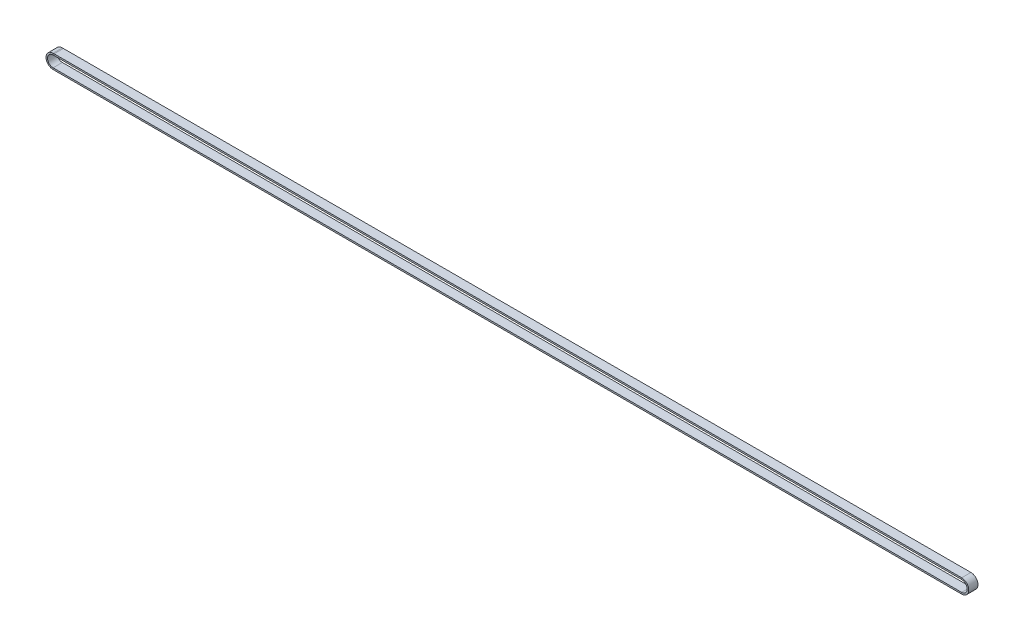
ISO-10303-21;
HEADER;
FILE_DESCRIPTION(('STEP AP214'),'2;1');
FILE_NAME('part.step','',(''),(''),'','','');
FILE_SCHEMA(('AUTOMOTIVE_DESIGN { 1 0 10303 214 1 1 1 1 }'));
ENDSEC;
DATA;
#1=APPLICATION_CONTEXT('core data for automotive mechanical design processes');
#2=APPLICATION_PROTOCOL_DEFINITION('international standard','automotive_design',2000,#1);
#3=PRODUCT_CONTEXT('',#1,'mechanical');
#4=PRODUCT('Part','Part','',(#3));
#5=PRODUCT_RELATED_PRODUCT_CATEGORY('part','',(#4));
#6=PRODUCT_DEFINITION_FORMATION('','',#4);
#7=PRODUCT_DEFINITION_CONTEXT('part definition',#1,'design');
#8=PRODUCT_DEFINITION('design','',#6,#7);
#9=PRODUCT_DEFINITION_SHAPE('','',#8);
#10=(LENGTH_UNIT() NAMED_UNIT(*) SI_UNIT(.MILLI.,.METRE.));
#11=(NAMED_UNIT(*) PLANE_ANGLE_UNIT() SI_UNIT($,.RADIAN.));
#12=(NAMED_UNIT(*) SI_UNIT($,.STERADIAN.) SOLID_ANGLE_UNIT());
#13=UNCERTAINTY_MEASURE_WITH_UNIT(LENGTH_MEASURE(1.E-05),#10,'distance_accuracy_value','');
#14=(GEOMETRIC_REPRESENTATION_CONTEXT(3) GLOBAL_UNCERTAINTY_ASSIGNED_CONTEXT((#13)) GLOBAL_UNIT_ASSIGNED_CONTEXT((#10,
#11,#12)) REPRESENTATION_CONTEXT('',''));
#15=CARTESIAN_POINT('',(0.,0.,0.));
#16=DIRECTION('',(0.,0.,1.));
#17=DIRECTION('',(1.,0.,0.));
#18=AXIS2_PLACEMENT_3D('',#15,#16,#17);
#19=CARTESIAN_POINT('',(883.5206378304,146.879342702496,-150.483366657725));
#20=DIRECTION('',(0.,0.,1.));
#21=DIRECTION('',(1.,0.,0.));
#22=AXIS2_PLACEMENT_3D('',#19,#20,#21);
#23=PLANE('',#22);
#24=DIRECTION('',(0.,1.,0.));
#25=VECTOR('',#24,1.);
#26=CARTESIAN_POINT('',(883.520637831255,146.879342702496,-150.483366657725));
#27=LINE('',#26,#25);
#28=CARTESIAN_POINT('',(883.520637831255,146.879342702496,-150.483366657725));
#29=VERTEX_POINT('',#28);
#30=CARTESIAN_POINT('',(883.520637831255,148.379342702496,-150.483366657725));
#31=VERTEX_POINT('',#30);
#32=EDGE_CURVE('E169',#29,#31,#27,.T.);
#33=ORIENTED_EDGE('',*,*,#32,.F.);
#34=DIRECTION('',(-1.,0.,0.));
#35=VECTOR('',#34,1.);
#36=CARTESIAN_POINT('',(883.5206378304,146.879342702496,-150.483366657725));
#37=LINE('',#36,#35);
#38=CARTESIAN_POINT('',(0.,146.879342702496,-150.483366657725));
#39=VERTEX_POINT('',#38);
#40=EDGE_CURVE('E168',#29,#39,#37,.T.);
#41=ORIENTED_EDGE('',*,*,#40,.T.);
#42=DIRECTION('',(0.,1.,0.));
#43=VECTOR('',#42,1.);
#44=CARTESIAN_POINT('',(0.,146.879342702496,-150.483366657725));
#45=LINE('',#44,#43);
#46=CARTESIAN_POINT('',(0.,148.379342702496,-150.483366657725));
#47=VERTEX_POINT('',#46);
#48=EDGE_CURVE('E143',#39,#47,#45,.T.);
#49=ORIENTED_EDGE('',*,*,#48,.T.);
#50=DIRECTION('',(-1.,0.,0.));
#51=VECTOR('',#50,1.);
#52=CARTESIAN_POINT('',(883.5206378304,148.379342702496,-150.483366657725));
#53=LINE('',#52,#51);
#54=EDGE_CURVE('E173',#31,#47,#53,.T.);
#55=ORIENTED_EDGE('',*,*,#54,.F.);
#56=EDGE_LOOP('',(#33,#41,#49,#55));
#57=FACE_BOUND('',#56,.T.);
#58=ADVANCED_FACE('F35',(#57),#23,.F.);
#59=CARTESIAN_POINT('',(0.,146.879342702496,-150.483366657725));
#60=DIRECTION('',(0.,0.,1.));
#61=DIRECTION('',(1.,0.,0.));
#62=AXIS2_PLACEMENT_3D('',#59,#60,#61);
#63=PLANE('',#62);
#64=DIRECTION('',(-1.,0.,0.));
#65=VECTOR('',#64,1.);
#66=CARTESIAN_POINT('',(0.,148.379342702496,-150.483366657725));
#67=LINE('',#66,#65);
#68=CARTESIAN_POINT('',(-1.00000000014302,148.379342702496,-150.483366657725));
#69=VERTEX_POINT('',#68);
#70=EDGE_CURVE('E149',#47,#69,#67,.T.);
#71=ORIENTED_EDGE('',*,*,#70,.F.);
#72=ORIENTED_EDGE('',*,*,#48,.F.);
#73=DIRECTION('',(-1.,0.,0.));
#74=VECTOR('',#73,1.);
#75=CARTESIAN_POINT('',(0.,146.879342702496,-150.483366657725));
#76=LINE('',#75,#74);
#77=CARTESIAN_POINT('',(-1.00000000014302,146.879342702496,-150.483366657725));
#78=VERTEX_POINT('',#77);
#79=EDGE_CURVE('E147',#39,#78,#76,.T.);
#80=ORIENTED_EDGE('',*,*,#79,.T.);
#81=DIRECTION('',(0.,1.,0.));
#82=VECTOR('',#81,1.);
#83=CARTESIAN_POINT('',(-1.00000000014302,146.879342702496,-150.483366657725));
#84=LINE('',#83,#82);
#85=EDGE_CURVE('E165',#78,#69,#84,.T.);
#86=ORIENTED_EDGE('',*,*,#85,.T.);
#87=EDGE_LOOP('',(#71,#72,#80,#86));
#88=FACE_BOUND('',#87,.T.);
#89=ADVANCED_FACE('F145',(#88),#63,.F.);
#90=CARTESIAN_POINT('',(0.,148.379342702496,-150.483366657725));
#91=DIRECTION('',(0.,-1.,0.));
#92=DIRECTION('',(0.,0.,-1.));
#93=AXIS2_PLACEMENT_3D('',#90,#91,#92);
#94=PLANE('',#93);
#95=DIRECTION('',(-1.,0.,0.));
#96=VECTOR('',#95,1.);
#97=CARTESIAN_POINT('',(0.,148.379342702496,-141.483366657725));
#98=LINE('',#97,#96);
#99=CARTESIAN_POINT('',(0.,148.379342702496,-141.483366657725));
#100=VERTEX_POINT('',#99);
#101=CARTESIAN_POINT('',(-1.00000000014302,148.379342702496,-141.483366657725));
#102=VERTEX_POINT('',#101);
#103=EDGE_CURVE('E214',#100,#102,#98,.T.);
#104=ORIENTED_EDGE('',*,*,#103,.F.);
#105=DIRECTION('',(0.,0.,1.));
#106=VECTOR('',#105,1.);
#107=CARTESIAN_POINT('',(0.,148.379342702496,-150.483366657725));
#108=LINE('',#107,#106);
#109=EDGE_CURVE('E154',#47,#100,#108,.T.);
#110=ORIENTED_EDGE('',*,*,#109,.F.);
#111=ORIENTED_EDGE('',*,*,#70,.T.);
#112=DIRECTION('',(0.,0.,1.));
#113=VECTOR('',#112,1.);
#114=CARTESIAN_POINT('',(-1.00000000014302,148.379342702496,-150.483366657725));
#115=LINE('',#114,#113);
#116=EDGE_CURVE('E239',#69,#102,#115,.T.);
#117=ORIENTED_EDGE('',*,*,#116,.T.);
#118=EDGE_LOOP('',(#104,#110,#111,#117));
#119=FACE_BOUND('',#118,.T.);
#120=ADVANCED_FACE('F259',(#119),#94,.F.);
#121=CARTESIAN_POINT('',(0.,146.879342702496,-141.483366657725));
#122=DIRECTION('',(0.,0.,-1.));
#123=DIRECTION('',(-1.,0.,0.));
#124=AXIS2_PLACEMENT_3D('',#121,#122,#123);
#125=PLANE('',#124);
#126=DIRECTION('',(-1.,0.,0.));
#127=VECTOR('',#126,1.);
#128=CARTESIAN_POINT('',(0.,146.879342702496,-141.483366657725));
#129=LINE('',#128,#127);
#130=CARTESIAN_POINT('',(0.,146.879342702496,-141.483366657725));
#131=VERTEX_POINT('',#130);
#132=CARTESIAN_POINT('',(-1.00000000014302,146.879342702496,-141.483366657725));
#133=VERTEX_POINT('',#132);
#134=EDGE_CURVE('E184',#131,#133,#129,.T.);
#135=ORIENTED_EDGE('',*,*,#134,.F.);
#136=DIRECTION('',(0.,-1.,0.));
#137=VECTOR('',#136,1.);
#138=CARTESIAN_POINT('',(0.,146.879342702496,-141.483366657725));
#139=LINE('',#138,#137);
#140=EDGE_CURVE('E176',#100,#131,#139,.T.);
#141=ORIENTED_EDGE('',*,*,#140,.F.);
#142=ORIENTED_EDGE('',*,*,#103,.T.);
#143=DIRECTION('',(0.,-1.,0.));
#144=VECTOR('',#143,1.);
#145=CARTESIAN_POINT('',(-1.00000000014302,146.879342702496,-141.483366657725));
#146=LINE('',#145,#144);
#147=EDGE_CURVE('E216',#102,#133,#146,.T.);
#148=ORIENTED_EDGE('',*,*,#147,.T.);
#149=EDGE_LOOP('',(#135,#141,#142,#148));
#150=FACE_BOUND('',#149,.T.);
#151=ADVANCED_FACE('F212',(#150),#125,.F.);
#152=CARTESIAN_POINT('',(0.,146.879342702496,-150.483366657725));
#153=DIRECTION('',(0.,1.,0.));
#154=DIRECTION('',(0.,0.,1.));
#155=AXIS2_PLACEMENT_3D('',#152,#153,#154);
#156=PLANE('',#155);
#157=DIRECTION('',(0.,0.,-1.));
#158=VECTOR('',#157,1.);
#159=CARTESIAN_POINT('',(-1.00000000014302,146.879342702496,-150.483366657725));
#160=LINE('',#159,#158);
#161=EDGE_CURVE('E163',#133,#78,#160,.T.);
#162=ORIENTED_EDGE('',*,*,#161,.T.);
#163=ORIENTED_EDGE('',*,*,#79,.F.);
#164=DIRECTION('',(0.,0.,-1.));
#165=VECTOR('',#164,1.);
#166=CARTESIAN_POINT('',(0.,146.879342702496,-150.483366657725));
#167=LINE('',#166,#165);
#168=EDGE_CURVE('E161',#131,#39,#167,.T.);
#169=ORIENTED_EDGE('',*,*,#168,.F.);
#170=ORIENTED_EDGE('',*,*,#134,.T.);
#171=EDGE_LOOP('',(#162,#163,#169,#170));
#172=FACE_BOUND('',#171,.T.);
#173=ADVANCED_FACE('F159',(#172),#156,.F.);
#174=CARTESIAN_POINT('',(-0.999999999287486,146.879342702496,-150.483366657725));
#175=DIRECTION('',(0.,0.,1.));
#176=DIRECTION('',(1.,0.,0.));
#177=AXIS2_PLACEMENT_3D('',#174,#175,#176);
#178=PLANE('',#177);
#179=CARTESIAN_POINT('',(-1.00000000010324,141.479342702496,-150.483366657725));
#180=DIRECTION('',(0.,0.,1.));
#181=DIRECTION('',(1.18225081747361E-10,1.,0.));
#182=AXIS2_PLACEMENT_3D('',#179,#180,#181);
#183=CIRCLE('',#182,6.89999999999999);
#184=CARTESIAN_POINT('',(-1.0000000000635,134.579342702496,-150.483366657725));
#185=VERTEX_POINT('',#184);
#186=EDGE_CURVE('E128',#69,#185,#183,.T.);
#187=ORIENTED_EDGE('',*,*,#186,.F.);
#188=ORIENTED_EDGE('',*,*,#85,.F.);
#189=CARTESIAN_POINT('',(-1.00000000010324,141.479342702496,-150.483366657725));
#190=DIRECTION('',(0.,0.,1.));
#191=DIRECTION('',(1.51065382232739E-10,1.,0.));
#192=AXIS2_PLACEMENT_3D('',#189,#190,#191);
#193=CIRCLE('',#192,5.39999999999999);
#194=CARTESIAN_POINT('',(-1.00000000007214,136.079342702496,-150.483366657725));
#195=VERTEX_POINT('',#194);
#196=EDGE_CURVE('E183',#78,#195,#193,.T.);
#197=ORIENTED_EDGE('',*,*,#196,.T.);
#198=DIRECTION('',(5.75887340029396E-12,-1.,0.));
#199=VECTOR('',#198,1.);
#200=CARTESIAN_POINT('',(-1.00000000007214,136.079342702496,-150.483366657725));
#201=LINE('',#200,#199);
#202=EDGE_CURVE('E244',#195,#185,#201,.T.);
#203=ORIENTED_EDGE('',*,*,#202,.T.);
#204=EDGE_LOOP('',(#187,#188,#197,#203));
#205=FACE_BOUND('',#204,.T.);
#206=ADVANCED_FACE('F284',(#205),#178,.F.);
#207=CARTESIAN_POINT('',(-1.00000000010324,141.479342702496,-150.483366657725));
#208=DIRECTION('',(0.,0.,1.));
#209=DIRECTION('',(1.,0.,0.));
#210=AXIS2_PLACEMENT_3D('',#207,#208,#209);
#211=CYLINDRICAL_SURFACE('',#210,6.89999999999999);
#212=CARTESIAN_POINT('',(-1.00000000010324,141.479342702496,-141.483366657725));
#213=DIRECTION('',(0.,0.,1.));
#214=DIRECTION('',(1.18225081747361E-10,1.,0.));
#215=AXIS2_PLACEMENT_3D('',#212,#213,#214);
#216=CIRCLE('',#215,6.89999999999999);
#217=CARTESIAN_POINT('',(-1.0000000000635,134.579342702496,-141.483366657725));
#218=VERTEX_POINT('',#217);
#219=EDGE_CURVE('E122',#102,#218,#216,.T.);
#220=ORIENTED_EDGE('',*,*,#219,.F.);
#221=ORIENTED_EDGE('',*,*,#116,.F.);
#222=ORIENTED_EDGE('',*,*,#186,.T.);
#223=DIRECTION('',(0.,0.,1.));
#224=VECTOR('',#223,1.);
#225=CARTESIAN_POINT('',(-1.0000000000635,134.579342702496,-150.483366657725));
#226=LINE('',#225,#224);
#227=EDGE_CURVE('E221',#185,#218,#226,.T.);
#228=ORIENTED_EDGE('',*,*,#227,.T.);
#229=EDGE_LOOP('',(#220,#221,#222,#228));
#230=FACE_BOUND('',#229,.T.);
#231=ADVANCED_FACE('F286',(#230),#211,.T.);
#232=CARTESIAN_POINT('',(-0.999999999287486,146.879342702496,-141.483366657725));
#233=DIRECTION('',(0.,0.,-1.));
#234=DIRECTION('',(-1.,0.,0.));
#235=AXIS2_PLACEMENT_3D('',#232,#233,#234);
#236=PLANE('',#235);
#237=CARTESIAN_POINT('',(-1.00000000010324,141.479342702496,-141.483366657725));
#238=DIRECTION('',(0.,0.,1.));
#239=DIRECTION('',(1.51065382232739E-10,1.,0.));
#240=AXIS2_PLACEMENT_3D('',#237,#238,#239);
#241=CIRCLE('',#240,5.39999999999999);
#242=CARTESIAN_POINT('',(-1.00000000007214,136.079342702496,-141.483366657725));
#243=VERTEX_POINT('',#242);
#244=EDGE_CURVE('E188',#133,#243,#241,.T.);
#245=ORIENTED_EDGE('',*,*,#244,.F.);
#246=ORIENTED_EDGE('',*,*,#147,.F.);
#247=ORIENTED_EDGE('',*,*,#219,.T.);
#248=DIRECTION('',(-5.75887340029396E-12,1.,0.));
#249=VECTOR('',#248,1.);
#250=CARTESIAN_POINT('',(-1.00000000007214,136.079342702496,-141.483366657725));
#251=LINE('',#250,#249);
#252=EDGE_CURVE('E220',#218,#243,#251,.T.);
#253=ORIENTED_EDGE('',*,*,#252,.T.);
#254=EDGE_LOOP('',(#245,#246,#247,#253));
#255=FACE_BOUND('',#254,.T.);
#256=ADVANCED_FACE('F292',(#255),#236,.F.);
#257=CARTESIAN_POINT('',(-1.00000000010324,141.479342702496,-150.483366657725));
#258=DIRECTION('',(0.,0.,1.));
#259=DIRECTION('',(1.,0.,0.));
#260=AXIS2_PLACEMENT_3D('',#257,#258,#259);
#261=CYLINDRICAL_SURFACE('',#260,5.39999999999999);
#262=DIRECTION('',(0.,0.,-1.));
#263=VECTOR('',#262,1.);
#264=CARTESIAN_POINT('',(-1.00000000007214,136.079342702496,-150.483366657725));
#265=LINE('',#264,#263);
#266=EDGE_CURVE('E185',#243,#195,#265,.T.);
#267=ORIENTED_EDGE('',*,*,#266,.T.);
#268=ORIENTED_EDGE('',*,*,#196,.F.);
#269=ORIENTED_EDGE('',*,*,#161,.F.);
#270=ORIENTED_EDGE('',*,*,#244,.T.);
#271=EDGE_LOOP('',(#267,#268,#269,#270));
#272=FACE_BOUND('',#271,.T.);
#273=ADVANCED_FACE('F282',(#272),#261,.F.);
#274=CARTESIAN_POINT('',(-1.00000000006351,136.079342702496,-150.483366657725));
#275=DIRECTION('',(0.,0.,1.));
#276=DIRECTION('',(1.,0.,0.));
#277=AXIS2_PLACEMENT_3D('',#274,#275,#276);
#278=PLANE('',#277);
#279=DIRECTION('',(1.,0.,0.));
#280=VECTOR('',#279,1.);
#281=CARTESIAN_POINT('',(-1.00000000006351,134.579342702496,-150.483366657725));
#282=LINE('',#281,#280);
#283=CARTESIAN_POINT('',(883.52063783048,134.579342702496,-150.483366657725));
#284=VERTEX_POINT('',#283);
#285=EDGE_CURVE('E105',#185,#284,#282,.T.);
#286=ORIENTED_EDGE('',*,*,#285,.F.);
#287=ORIENTED_EDGE('',*,*,#202,.F.);
#288=DIRECTION('',(1.,0.,0.));
#289=VECTOR('',#288,1.);
#290=CARTESIAN_POINT('',(-1.00000000006351,136.079342702496,-150.483366657725));
#291=LINE('',#290,#289);
#292=CARTESIAN_POINT('',(883.52063783048,136.079342702496,-150.483366657725));
#293=VERTEX_POINT('',#292);
#294=EDGE_CURVE('E187',#195,#293,#291,.T.);
#295=ORIENTED_EDGE('',*,*,#294,.T.);
#296=DIRECTION('',(0.,-1.,0.));
#297=VECTOR('',#296,1.);
#298=CARTESIAN_POINT('',(883.52063783048,136.079342702496,-150.483366657725));
#299=LINE('',#298,#297);
#300=EDGE_CURVE('E197',#293,#284,#299,.T.);
#301=ORIENTED_EDGE('',*,*,#300,.T.);
#302=EDGE_LOOP('',(#286,#287,#295,#301));
#303=FACE_BOUND('',#302,.T.);
#304=ADVANCED_FACE('F278',(#303),#278,.F.);
#305=CARTESIAN_POINT('',(-1.00000000006351,134.579342702496,-150.483366657725));
#306=DIRECTION('',(0.,1.,0.));
#307=DIRECTION('',(0.,0.,1.));
#308=AXIS2_PLACEMENT_3D('',#305,#306,#307);
#309=PLANE('',#308);
#310=DIRECTION('',(1.,0.,0.));
#311=VECTOR('',#310,1.);
#312=CARTESIAN_POINT('',(-1.00000000006351,134.579342702496,-141.483366657725));
#313=LINE('',#312,#311);
#314=CARTESIAN_POINT('',(883.52063783048,134.579342702496,-141.483366657725));
#315=VERTEX_POINT('',#314);
#316=EDGE_CURVE('E98',#218,#315,#313,.T.);
#317=ORIENTED_EDGE('',*,*,#316,.F.);
#318=ORIENTED_EDGE('',*,*,#227,.F.);
#319=ORIENTED_EDGE('',*,*,#285,.T.);
#320=DIRECTION('',(0.,0.,1.));
#321=VECTOR('',#320,1.);
#322=CARTESIAN_POINT('',(883.52063783048,134.579342702496,-150.483366657725));
#323=LINE('',#322,#321);
#324=EDGE_CURVE('E195',#284,#315,#323,.T.);
#325=ORIENTED_EDGE('',*,*,#324,.T.);
#326=EDGE_LOOP('',(#317,#318,#319,#325));
#327=FACE_BOUND('',#326,.T.);
#328=ADVANCED_FACE('F281',(#327),#309,.F.);
#329=CARTESIAN_POINT('',(-1.00000000006351,136.079342702496,-141.483366657725));
#330=DIRECTION('',(0.,0.,-1.));
#331=DIRECTION('',(-1.,0.,0.));
#332=AXIS2_PLACEMENT_3D('',#329,#330,#331);
#333=PLANE('',#332);
#334=DIRECTION('',(1.,0.,0.));
#335=VECTOR('',#334,1.);
#336=CARTESIAN_POINT('',(-1.00000000006351,136.079342702496,-141.483366657725));
#337=LINE('',#336,#335);
#338=CARTESIAN_POINT('',(883.52063783048,136.079342702496,-141.483366657725));
#339=VERTEX_POINT('',#338);
#340=EDGE_CURVE('E89',#243,#339,#337,.T.);
#341=ORIENTED_EDGE('',*,*,#340,.F.);
#342=ORIENTED_EDGE('',*,*,#252,.F.);
#343=ORIENTED_EDGE('',*,*,#316,.T.);
#344=DIRECTION('',(0.,1.,0.));
#345=VECTOR('',#344,1.);
#346=CARTESIAN_POINT('',(883.52063783048,136.079342702496,-141.483366657725));
#347=LINE('',#346,#345);
#348=EDGE_CURVE('E191',#315,#339,#347,.T.);
#349=ORIENTED_EDGE('',*,*,#348,.T.);
#350=EDGE_LOOP('',(#341,#342,#343,#349));
#351=FACE_BOUND('',#350,.T.);
#352=ADVANCED_FACE('F296',(#351),#333,.F.);
#353=CARTESIAN_POINT('',(-1.00000000006351,136.079342702496,-150.483366657725));
#354=DIRECTION('',(0.,-1.,0.));
#355=DIRECTION('',(0.,0.,-1.));
#356=AXIS2_PLACEMENT_3D('',#353,#354,#355);
#357=PLANE('',#356);
#358=DIRECTION('',(0.,0.,-1.));
#359=VECTOR('',#358,1.);
#360=CARTESIAN_POINT('',(883.52063783048,136.079342702496,-150.483366657725));
#361=LINE('',#360,#359);
#362=EDGE_CURVE('E189',#339,#293,#361,.T.);
#363=ORIENTED_EDGE('',*,*,#362,.T.);
#364=ORIENTED_EDGE('',*,*,#294,.F.);
#365=ORIENTED_EDGE('',*,*,#266,.F.);
#366=ORIENTED_EDGE('',*,*,#340,.T.);
#367=EDGE_LOOP('',(#363,#364,#365,#366));
#368=FACE_BOUND('',#367,.T.);
#369=ADVANCED_FACE('F277',(#368),#357,.F.);
#370=CARTESIAN_POINT('',(883.520637830471,136.079342702496,-150.483366657725));
#371=DIRECTION('',(0.,0.,1.));
#372=DIRECTION('',(1.,0.,0.));
#373=AXIS2_PLACEMENT_3D('',#370,#371,#372);
#374=PLANE('',#373);
#375=CARTESIAN_POINT('',(883.52063783044,141.479342702496,-150.483366657725));
#376=DIRECTION('',(0.,0.,1.));
#377=DIRECTION('',(5.76028757704068E-12,-1.,0.));
#378=AXIS2_PLACEMENT_3D('',#375,#376,#377);
#379=CIRCLE('',#378,6.89999999999999);
#380=EDGE_CURVE('E229',#284,#31,#379,.T.);
#381=ORIENTED_EDGE('',*,*,#380,.F.);
#382=ORIENTED_EDGE('',*,*,#300,.F.);
#383=CARTESIAN_POINT('',(883.52063783044,141.479342702496,-150.483366657725));
#384=DIRECTION('',(0.,0.,1.));
#385=DIRECTION('',(5.75671197953786E-12,-1.,0.));
#386=AXIS2_PLACEMENT_3D('',#383,#384,#385);
#387=CIRCLE('',#386,5.39999999999999);
#388=EDGE_CURVE('E190',#293,#29,#387,.T.);
#389=ORIENTED_EDGE('',*,*,#388,.T.);
#390=ORIENTED_EDGE('',*,*,#32,.T.);
#391=EDGE_LOOP('',(#381,#382,#389,#390));
#392=FACE_BOUND('',#391,.T.);
#393=ADVANCED_FACE('F274',(#392),#374,.F.);
#394=CARTESIAN_POINT('',(883.52063783044,141.479342702496,-150.483366657725));
#395=DIRECTION('',(0.,0.,1.));
#396=DIRECTION('',(1.,0.,0.));
#397=AXIS2_PLACEMENT_3D('',#394,#395,#396);
#398=CYLINDRICAL_SURFACE('',#397,6.89999999999999);
#399=CARTESIAN_POINT('',(883.52063783044,141.479342702496,-141.483366657725));
#400=DIRECTION('',(0.,0.,1.));
#401=DIRECTION('',(5.76028757704068E-12,-1.,0.));
#402=AXIS2_PLACEMENT_3D('',#399,#400,#401);
#403=CIRCLE('',#402,6.89999999999999);
#404=CARTESIAN_POINT('',(883.520637831255,148.379342702496,-141.483366657725));
#405=VERTEX_POINT('',#404);
#406=EDGE_CURVE('E60',#315,#405,#403,.T.);
#407=ORIENTED_EDGE('',*,*,#406,.F.);
#408=ORIENTED_EDGE('',*,*,#324,.F.);
#409=ORIENTED_EDGE('',*,*,#380,.T.);
#410=DIRECTION('',(0.,0.,1.));
#411=VECTOR('',#410,1.);
#412=CARTESIAN_POINT('',(883.520637831255,148.379342702496,-150.483366657725));
#413=LINE('',#412,#411);
#414=EDGE_CURVE('E227',#31,#405,#413,.T.);
#415=ORIENTED_EDGE('',*,*,#414,.T.);
#416=EDGE_LOOP('',(#407,#408,#409,#415));
#417=FACE_BOUND('',#416,.T.);
#418=ADVANCED_FACE('F255',(#417),#398,.T.);
#419=CARTESIAN_POINT('',(883.520637830471,136.079342702496,-141.483366657725));
#420=DIRECTION('',(0.,0.,-1.));
#421=DIRECTION('',(-1.,0.,0.));
#422=AXIS2_PLACEMENT_3D('',#419,#420,#421);
#423=PLANE('',#422);
#424=CARTESIAN_POINT('',(883.52063783044,141.479342702496,-141.483366657725));
#425=DIRECTION('',(0.,0.,1.));
#426=DIRECTION('',(5.75671197953786E-12,-1.,0.));
#427=AXIS2_PLACEMENT_3D('',#424,#425,#426);
#428=CIRCLE('',#427,5.39999999999999);
#429=CARTESIAN_POINT('',(883.520637831255,146.879342702496,-141.483366657725));
#430=VERTEX_POINT('',#429);
#431=EDGE_CURVE('E52',#339,#430,#428,.T.);
#432=ORIENTED_EDGE('',*,*,#431,.F.);
#433=ORIENTED_EDGE('',*,*,#348,.F.);
#434=ORIENTED_EDGE('',*,*,#406,.T.);
#435=DIRECTION('',(0.,-1.,0.));
#436=VECTOR('',#435,1.);
#437=CARTESIAN_POINT('',(883.520637831255,146.879342702496,-141.483366657725));
#438=LINE('',#437,#436);
#439=EDGE_CURVE('E203',#405,#430,#438,.T.);
#440=ORIENTED_EDGE('',*,*,#439,.T.);
#441=EDGE_LOOP('',(#432,#433,#434,#440));
#442=FACE_BOUND('',#441,.T.);
#443=ADVANCED_FACE('F305',(#442),#423,.F.);
#444=CARTESIAN_POINT('',(883.52063783044,141.479342702496,-150.483366657725));
#445=DIRECTION('',(0.,0.,1.));
#446=DIRECTION('',(1.,0.,0.));
#447=AXIS2_PLACEMENT_3D('',#444,#445,#446);
#448=CYLINDRICAL_SURFACE('',#447,5.39999999999999);
#449=DIRECTION('',(0.,0.,-1.));
#450=VECTOR('',#449,1.);
#451=CARTESIAN_POINT('',(883.520637831255,146.879342702496,-150.483366657725));
#452=LINE('',#451,#450);
#453=EDGE_CURVE('E39',#430,#29,#452,.T.);
#454=ORIENTED_EDGE('',*,*,#453,.T.);
#455=ORIENTED_EDGE('',*,*,#388,.F.);
#456=ORIENTED_EDGE('',*,*,#362,.F.);
#457=ORIENTED_EDGE('',*,*,#431,.T.);
#458=EDGE_LOOP('',(#454,#455,#456,#457));
#459=FACE_BOUND('',#458,.T.);
#460=ADVANCED_FACE('F204',(#459),#448,.F.);
#461=CARTESIAN_POINT('',(883.5206378304,148.379342702496,-150.483366657725));
#462=DIRECTION('',(0.,-1.,0.));
#463=DIRECTION('',(0.,0.,-1.));
#464=AXIS2_PLACEMENT_3D('',#461,#462,#463);
#465=PLANE('',#464);
#466=ORIENTED_EDGE('',*,*,#54,.T.);
#467=ORIENTED_EDGE('',*,*,#109,.T.);
#468=DIRECTION('',(-1.,0.,0.));
#469=VECTOR('',#468,1.);
#470=CARTESIAN_POINT('',(883.5206378304,148.379342702496,-141.483366657725));
#471=LINE('',#470,#469);
#472=EDGE_CURVE('E44',#405,#100,#471,.T.);
#473=ORIENTED_EDGE('',*,*,#472,.F.);
#474=ORIENTED_EDGE('',*,*,#414,.F.);
#475=EDGE_LOOP('',(#466,#467,#473,#474));
#476=FACE_BOUND('',#475,.T.);
#477=ADVANCED_FACE('F258',(#476),#465,.F.);
#478=CARTESIAN_POINT('',(883.5206378304,146.879342702496,-141.483366657725));
#479=DIRECTION('',(0.,0.,-1.));
#480=DIRECTION('',(-1.,0.,0.));
#481=AXIS2_PLACEMENT_3D('',#478,#479,#480);
#482=PLANE('',#481);
#483=ORIENTED_EDGE('',*,*,#472,.T.);
#484=ORIENTED_EDGE('',*,*,#140,.T.);
#485=DIRECTION('',(-1.,0.,0.));
#486=VECTOR('',#485,1.);
#487=CARTESIAN_POINT('',(883.5206378304,146.879342702496,-141.483366657725));
#488=LINE('',#487,#486);
#489=EDGE_CURVE('E11',#430,#131,#488,.T.);
#490=ORIENTED_EDGE('',*,*,#489,.F.);
#491=ORIENTED_EDGE('',*,*,#439,.F.);
#492=EDGE_LOOP('',(#483,#484,#490,#491));
#493=FACE_BOUND('',#492,.T.);
#494=ADVANCED_FACE('F208',(#493),#482,.F.);
#495=CARTESIAN_POINT('',(883.5206378304,146.879342702496,-150.483366657725));
#496=DIRECTION('',(0.,1.,0.));
#497=DIRECTION('',(0.,0.,1.));
#498=AXIS2_PLACEMENT_3D('',#495,#496,#497);
#499=PLANE('',#498);
#500=ORIENTED_EDGE('',*,*,#489,.T.);
#501=ORIENTED_EDGE('',*,*,#168,.T.);
#502=ORIENTED_EDGE('',*,*,#40,.F.);
#503=ORIENTED_EDGE('',*,*,#453,.F.);
#504=EDGE_LOOP('',(#500,#501,#502,#503));
#505=FACE_BOUND('',#504,.T.);
#506=ADVANCED_FACE('F37',(#505),#499,.F.);
#507=CLOSED_SHELL('',(#58,#89,#120,#151,#173,#206,#231,#256,#273,#304,#328,#352,#369,#393,#418,
#443,#460,#477,#494,#506));
#508=MANIFOLD_SOLID_BREP('B2',#507);
#509=ADVANCED_BREP_SHAPE_REPRESENTATION('',(#18,#508),#14);
#510=SHAPE_DEFINITION_REPRESENTATION(#9,#509);
ENDSEC;
END-ISO-10303-21;
